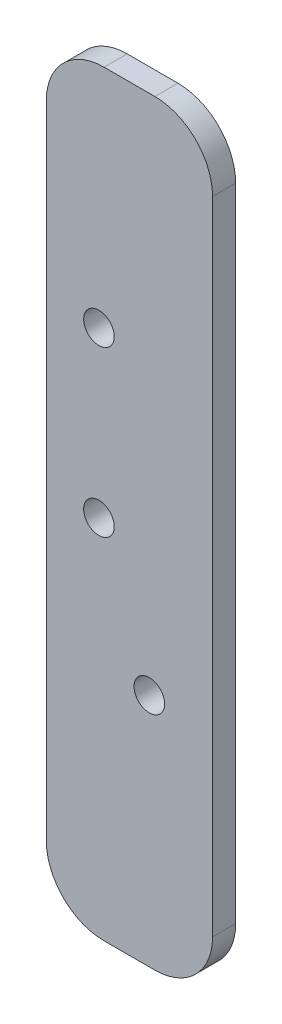
ISO-10303-21;
HEADER;
FILE_DESCRIPTION(('STEP AP214'),'2;1');
FILE_NAME('part.step','',(''),(''),'','','');
FILE_SCHEMA(('AUTOMOTIVE_DESIGN { 1 0 10303 214 1 1 1 1 }'));
ENDSEC;
DATA;
#1=APPLICATION_CONTEXT('core data for automotive mechanical design processes');
#2=APPLICATION_PROTOCOL_DEFINITION('international standard','automotive_design',2000,#1);
#3=PRODUCT_CONTEXT('',#1,'mechanical');
#4=PRODUCT('Part','Part','',(#3));
#5=PRODUCT_RELATED_PRODUCT_CATEGORY('part','',(#4));
#6=PRODUCT_DEFINITION_FORMATION('','',#4);
#7=PRODUCT_DEFINITION_CONTEXT('part definition',#1,'design');
#8=PRODUCT_DEFINITION('design','',#6,#7);
#9=PRODUCT_DEFINITION_SHAPE('','',#8);
#10=(LENGTH_UNIT() NAMED_UNIT(*) SI_UNIT(.MILLI.,.METRE.));
#11=(NAMED_UNIT(*) PLANE_ANGLE_UNIT() SI_UNIT($,.RADIAN.));
#12=(NAMED_UNIT(*) SI_UNIT($,.STERADIAN.) SOLID_ANGLE_UNIT());
#13=UNCERTAINTY_MEASURE_WITH_UNIT(LENGTH_MEASURE(1.E-05),#10,'distance_accuracy_value','');
#14=(GEOMETRIC_REPRESENTATION_CONTEXT(3) GLOBAL_UNCERTAINTY_ASSIGNED_CONTEXT((#13)) GLOBAL_UNIT_ASSIGNED_CONTEXT((#10,
#11,#12)) REPRESENTATION_CONTEXT('',''));
#15=CARTESIAN_POINT('',(0.,0.,0.));
#16=DIRECTION('',(0.,0.,1.));
#17=DIRECTION('',(1.,0.,0.));
#18=AXIS2_PLACEMENT_3D('',#15,#16,#17);
#19=CARTESIAN_POINT('',(-63.2759401965078,-253.855106797616,4.));
#20=DIRECTION('',(1.,0.,0.));
#21=DIRECTION('',(0.,0.,-1.));
#22=AXIS2_PLACEMENT_3D('',#19,#20,#21);
#23=PLANE('',#22);
#24=DIRECTION('',(0.,-1.,0.));
#25=VECTOR('',#24,1.);
#26=CARTESIAN_POINT('',(-63.2759401965078,-253.855106797616,4.));
#27=LINE('',#26,#25);
#28=CARTESIAN_POINT('',(-63.2759401965078,-263.855106797616,4.));
#29=VERTEX_POINT('',#28);
#30=CARTESIAN_POINT('',(-63.2759401965078,-374.933652969776,4.));
#31=VERTEX_POINT('',#30);
#32=EDGE_CURVE('E119',#29,#31,#27,.T.);
#33=ORIENTED_EDGE('',*,*,#32,.F.);
#34=DIRECTION('',(0.,0.,-1.));
#35=VECTOR('',#34,1.);
#36=CARTESIAN_POINT('',(-63.2759401965078,-263.855106797616,4.));
#37=LINE('',#36,#35);
#38=CARTESIAN_POINT('',(-63.2759401965078,-263.855106797616,0.));
#39=VERTEX_POINT('',#38);
#40=EDGE_CURVE('E104',#29,#39,#37,.T.);
#41=ORIENTED_EDGE('',*,*,#40,.T.);
#42=DIRECTION('',(0.,-1.,0.));
#43=VECTOR('',#42,1.);
#44=CARTESIAN_POINT('',(-63.2759401965078,-253.855106797616,0.));
#45=LINE('',#44,#43);
#46=CARTESIAN_POINT('',(-63.2759401965078,-374.933652969776,0.));
#47=VERTEX_POINT('',#46);
#48=EDGE_CURVE('E116',#39,#47,#45,.T.);
#49=ORIENTED_EDGE('',*,*,#48,.T.);
#50=DIRECTION('',(0.,0.,-1.));
#51=VECTOR('',#50,1.);
#52=CARTESIAN_POINT('',(-63.2759401965078,-374.933652969776,4.));
#53=LINE('',#52,#51);
#54=EDGE_CURVE('E121',#47,#31,#53,.F.);
#55=ORIENTED_EDGE('',*,*,#54,.T.);
#56=EDGE_LOOP('',(#33,#41,#49,#55));
#57=FACE_BOUND('',#56,.T.);
#58=ADVANCED_FACE('F33',(#57),#23,.F.);
#59=CARTESIAN_POINT('',(-63.2759401965078,-384.933652969776,4.));
#60=DIRECTION('',(0.,1.,0.));
#61=DIRECTION('',(0.,0.,1.));
#62=AXIS2_PLACEMENT_3D('',#59,#60,#61);
#63=PLANE('',#62);
#64=DIRECTION('',(1.,0.,0.));
#65=VECTOR('',#64,1.);
#66=CARTESIAN_POINT('',(-63.2759401965078,-384.933652969776,4.));
#67=LINE('',#66,#65);
#68=CARTESIAN_POINT('',(-53.2759401965078,-384.933652969776,4.));
#69=VERTEX_POINT('',#68);
#70=CARTESIAN_POINT('',(-44.4730785631655,-384.933652969776,4.));
#71=VERTEX_POINT('',#70);
#72=EDGE_CURVE('E163',#69,#71,#67,.T.);
#73=ORIENTED_EDGE('',*,*,#72,.F.);
#74=DIRECTION('',(0.,0.,-1.));
#75=VECTOR('',#74,1.);
#76=CARTESIAN_POINT('',(-53.2759401965078,-384.933652969776,4.));
#77=LINE('',#76,#75);
#78=CARTESIAN_POINT('',(-53.2759401965078,-384.933652969776,0.));
#79=VERTEX_POINT('',#78);
#80=EDGE_CURVE('E11',#69,#79,#77,.T.);
#81=ORIENTED_EDGE('',*,*,#80,.T.);
#82=DIRECTION('',(1.,0.,0.));
#83=VECTOR('',#82,1.);
#84=CARTESIAN_POINT('',(-63.2759401965078,-384.933652969776,0.));
#85=LINE('',#84,#83);
#86=CARTESIAN_POINT('',(-44.4730785631655,-384.933652969776,0.));
#87=VERTEX_POINT('',#86);
#88=EDGE_CURVE('E126',#79,#87,#85,.T.);
#89=ORIENTED_EDGE('',*,*,#88,.T.);
#90=DIRECTION('',(0.,0.,-1.));
#91=VECTOR('',#90,1.);
#92=CARTESIAN_POINT('',(-44.4730785631655,-384.933652969776,4.));
#93=LINE('',#92,#91);
#94=EDGE_CURVE('E41',#87,#71,#93,.F.);
#95=ORIENTED_EDGE('',*,*,#94,.T.);
#96=EDGE_LOOP('',(#73,#81,#89,#95));
#97=FACE_BOUND('',#96,.T.);
#98=ADVANCED_FACE('F162',(#97),#63,.F.);
#99=CARTESIAN_POINT('',(-34.4730785631655,-253.855106797616,4.));
#100=DIRECTION('',(-1.,0.,0.));
#101=DIRECTION('',(0.,0.,1.));
#102=AXIS2_PLACEMENT_3D('',#99,#100,#101);
#103=PLANE('',#102);
#104=DIRECTION('',(0.,1.,0.));
#105=VECTOR('',#104,1.);
#106=CARTESIAN_POINT('',(-34.4730785631655,-253.855106797616,0.));
#107=LINE('',#106,#105);
#108=CARTESIAN_POINT('',(-34.4730785631655,-374.933652969776,0.));
#109=VERTEX_POINT('',#108);
#110=CARTESIAN_POINT('',(-34.4730785631655,-263.855106797616,0.));
#111=VERTEX_POINT('',#110);
#112=EDGE_CURVE('E130',#109,#111,#107,.T.);
#113=ORIENTED_EDGE('',*,*,#112,.T.);
#114=DIRECTION('',(0.,0.,-1.));
#115=VECTOR('',#114,1.);
#116=CARTESIAN_POINT('',(-34.4730785631655,-263.855106797616,4.));
#117=LINE('',#116,#115);
#118=CARTESIAN_POINT('',(-34.4730785631655,-263.855106797616,4.));
#119=VERTEX_POINT('',#118);
#120=EDGE_CURVE('E48',#111,#119,#117,.F.);
#121=ORIENTED_EDGE('',*,*,#120,.T.);
#122=DIRECTION('',(0.,1.,0.));
#123=VECTOR('',#122,1.);
#124=CARTESIAN_POINT('',(-34.4730785631655,-253.855106797616,4.));
#125=LINE('',#124,#123);
#126=CARTESIAN_POINT('',(-34.4730785631655,-374.933652969776,4.));
#127=VERTEX_POINT('',#126);
#128=EDGE_CURVE('E169',#127,#119,#125,.T.);
#129=ORIENTED_EDGE('',*,*,#128,.F.);
#130=DIRECTION('',(0.,0.,-1.));
#131=VECTOR('',#130,1.);
#132=CARTESIAN_POINT('',(-34.4730785631655,-374.933652969776,4.));
#133=LINE('',#132,#131);
#134=EDGE_CURVE('E156',#127,#109,#133,.T.);
#135=ORIENTED_EDGE('',*,*,#134,.T.);
#136=EDGE_LOOP('',(#113,#121,#129,#135));
#137=FACE_BOUND('',#136,.T.);
#138=ADVANCED_FACE('F173',(#137),#103,.F.);
#139=CARTESIAN_POINT('',(-63.2759401965078,-253.855106797616,4.));
#140=DIRECTION('',(0.,-1.,0.));
#141=DIRECTION('',(0.,0.,-1.));
#142=AXIS2_PLACEMENT_3D('',#139,#140,#141);
#143=PLANE('',#142);
#144=DIRECTION('',(-1.,0.,0.));
#145=VECTOR('',#144,1.);
#146=CARTESIAN_POINT('',(-63.2759401965078,-253.855106797616,0.));
#147=LINE('',#146,#145);
#148=CARTESIAN_POINT('',(-44.4730785631655,-253.855106797616,0.));
#149=VERTEX_POINT('',#148);
#150=CARTESIAN_POINT('',(-53.2759401965078,-253.855106797616,0.));
#151=VERTEX_POINT('',#150);
#152=EDGE_CURVE('E140',#149,#151,#147,.T.);
#153=ORIENTED_EDGE('',*,*,#152,.T.);
#154=DIRECTION('',(0.,0.,-1.));
#155=VECTOR('',#154,1.);
#156=CARTESIAN_POINT('',(-53.2759401965078,-253.855106797616,4.));
#157=LINE('',#156,#155);
#158=CARTESIAN_POINT('',(-53.2759401965078,-253.855106797616,4.));
#159=VERTEX_POINT('',#158);
#160=EDGE_CURVE('E105',#151,#159,#157,.F.);
#161=ORIENTED_EDGE('',*,*,#160,.T.);
#162=DIRECTION('',(-1.,0.,0.));
#163=VECTOR('',#162,1.);
#164=CARTESIAN_POINT('',(-63.2759401965078,-253.855106797616,4.));
#165=LINE('',#164,#163);
#166=CARTESIAN_POINT('',(-44.4730785631655,-253.855106797616,4.));
#167=VERTEX_POINT('',#166);
#168=EDGE_CURVE('E136',#167,#159,#165,.T.);
#169=ORIENTED_EDGE('',*,*,#168,.F.);
#170=DIRECTION('',(0.,0.,-1.));
#171=VECTOR('',#170,1.);
#172=CARTESIAN_POINT('',(-44.4730785631655,-253.855106797616,4.));
#173=LINE('',#172,#171);
#174=EDGE_CURVE('E110',#167,#149,#173,.T.);
#175=ORIENTED_EDGE('',*,*,#174,.T.);
#176=EDGE_LOOP('',(#153,#161,#169,#175));
#177=FACE_BOUND('',#176,.T.);
#178=ADVANCED_FACE('F180',(#177),#143,.F.);
#179=CARTESIAN_POINT('',(0.,0.,4.));
#180=DIRECTION('',(0.,0.,1.));
#181=DIRECTION('',(1.,0.,0.));
#182=AXIS2_PLACEMENT_3D('',#179,#180,#181);
#183=PLANE('',#182);
#184=CARTESIAN_POINT('',(-45.4264270076822,-344.165502046719,4.));
#185=DIRECTION('',(0.,0.,-1.));
#186=DIRECTION('',(-1.,0.,0.));
#187=AXIS2_PLACEMENT_3D('',#184,#185,#186);
#188=CIRCLE('',#187,2.64999999999999);
#189=CARTESIAN_POINT('',(-48.0764270076822,-344.165502046719,4.));
#190=VERTEX_POINT('',#189);
#191=EDGE_CURVE('E191',#190,#190,#188,.T.);
#192=ORIENTED_EDGE('',*,*,#191,.T.);
#193=EDGE_LOOP('',(#192));
#194=FACE_BOUND('',#193,.T.);
#195=CARTESIAN_POINT('',(-54.16270611,-321.91568115646,4.));
#196=DIRECTION('',(0.,0.,1.));
#197=DIRECTION('',(1.,0.,0.));
#198=AXIS2_PLACEMENT_3D('',#195,#196,#197);
#199=CIRCLE('',#198,2.65);
#200=CARTESIAN_POINT('',(-51.51270611,-321.91568115646,4.));
#201=VERTEX_POINT('',#200);
#202=EDGE_CURVE('E188',#201,#201,#199,.T.);
#203=ORIENTED_EDGE('',*,*,#202,.F.);
#204=EDGE_LOOP('',(#203));
#205=FACE_BOUND('',#204,.T.);
#206=CARTESIAN_POINT('',(-54.16270611,-293.415681156461,4.));
#207=DIRECTION('',(0.,0.,1.));
#208=DIRECTION('',(1.,0.,0.));
#209=AXIS2_PLACEMENT_3D('',#206,#207,#208);
#210=CIRCLE('',#209,2.65);
#211=CARTESIAN_POINT('',(-51.51270611,-293.415681156461,4.));
#212=VERTEX_POINT('',#211);
#213=EDGE_CURVE('E133',#212,#212,#210,.T.);
#214=ORIENTED_EDGE('',*,*,#213,.F.);
#215=EDGE_LOOP('',(#214));
#216=FACE_BOUND('',#215,.T.);
#217=ORIENTED_EDGE('',*,*,#168,.T.);
#218=CARTESIAN_POINT('',(-53.2759401965078,-263.855106797616,4.));
#219=DIRECTION('',(0.,0.,1.));
#220=DIRECTION('',(1.,0.,0.));
#221=AXIS2_PLACEMENT_3D('',#218,#219,#220);
#222=CIRCLE('',#221,10.);
#223=EDGE_CURVE('E154',#159,#29,#222,.T.);
#224=ORIENTED_EDGE('',*,*,#223,.T.);
#225=ORIENTED_EDGE('',*,*,#32,.T.);
#226=CARTESIAN_POINT('',(-53.2759401965078,-374.933652969776,4.));
#227=DIRECTION('',(0.,0.,1.));
#228=DIRECTION('',(1.,0.,0.));
#229=AXIS2_PLACEMENT_3D('',#226,#227,#228);
#230=CIRCLE('',#229,10.);
#231=EDGE_CURVE('E150',#31,#69,#230,.T.);
#232=ORIENTED_EDGE('',*,*,#231,.T.);
#233=ORIENTED_EDGE('',*,*,#72,.T.);
#234=CARTESIAN_POINT('',(-44.4730785631655,-374.933652969776,4.));
#235=DIRECTION('',(0.,0.,1.));
#236=DIRECTION('',(1.,0.,0.));
#237=AXIS2_PLACEMENT_3D('',#234,#235,#236);
#238=CIRCLE('',#237,10.);
#239=EDGE_CURVE('E55',#71,#127,#238,.T.);
#240=ORIENTED_EDGE('',*,*,#239,.T.);
#241=ORIENTED_EDGE('',*,*,#128,.T.);
#242=CARTESIAN_POINT('',(-44.4730785631655,-263.855106797616,4.));
#243=DIRECTION('',(0.,0.,1.));
#244=DIRECTION('',(1.,0.,0.));
#245=AXIS2_PLACEMENT_3D('',#242,#243,#244);
#246=CIRCLE('',#245,10.);
#247=EDGE_CURVE('E152',#119,#167,#246,.T.);
#248=ORIENTED_EDGE('',*,*,#247,.T.);
#249=EDGE_LOOP('',(#217,#224,#225,#232,#233,#240,#241,#248));
#250=FACE_BOUND('',#249,.T.);
#251=ADVANCED_FACE('F167',(#194,#205,#216,#250),#183,.T.);
#252=CARTESIAN_POINT('',(0.,0.,0.));
#253=DIRECTION('',(0.,0.,1.));
#254=DIRECTION('',(1.,0.,0.));
#255=AXIS2_PLACEMENT_3D('',#252,#253,#254);
#256=PLANE('',#255);
#257=CARTESIAN_POINT('',(-45.4264270076822,-344.165502046719,0.));
#258=DIRECTION('',(0.,0.,-1.));
#259=DIRECTION('',(-1.,0.,0.));
#260=AXIS2_PLACEMENT_3D('',#257,#258,#259);
#261=CIRCLE('',#260,2.64999999999999);
#262=CARTESIAN_POINT('',(-48.0764270076822,-344.165502046719,0.));
#263=VERTEX_POINT('',#262);
#264=EDGE_CURVE('E194',#263,#263,#261,.T.);
#265=ORIENTED_EDGE('',*,*,#264,.F.);
#266=EDGE_LOOP('',(#265));
#267=FACE_BOUND('',#266,.T.);
#268=CARTESIAN_POINT('',(-54.16270611,-321.91568115646,0.));
#269=DIRECTION('',(0.,0.,1.));
#270=DIRECTION('',(1.,0.,0.));
#271=AXIS2_PLACEMENT_3D('',#268,#269,#270);
#272=CIRCLE('',#271,2.65);
#273=CARTESIAN_POINT('',(-51.51270611,-321.91568115646,0.));
#274=VERTEX_POINT('',#273);
#275=EDGE_CURVE('E185',#274,#274,#272,.T.);
#276=ORIENTED_EDGE('',*,*,#275,.T.);
#277=EDGE_LOOP('',(#276));
#278=FACE_BOUND('',#277,.T.);
#279=CARTESIAN_POINT('',(-54.16270611,-293.415681156461,0.));
#280=DIRECTION('',(0.,0.,1.));
#281=DIRECTION('',(1.,0.,0.));
#282=AXIS2_PLACEMENT_3D('',#279,#280,#281);
#283=CIRCLE('',#282,2.65);
#284=CARTESIAN_POINT('',(-51.51270611,-293.415681156461,0.));
#285=VERTEX_POINT('',#284);
#286=EDGE_CURVE('E127',#285,#285,#283,.T.);
#287=ORIENTED_EDGE('',*,*,#286,.T.);
#288=EDGE_LOOP('',(#287));
#289=FACE_BOUND('',#288,.T.);
#290=ORIENTED_EDGE('',*,*,#48,.F.);
#291=CARTESIAN_POINT('',(-53.2759401965078,-263.855106797616,0.));
#292=DIRECTION('',(0.,0.,1.));
#293=DIRECTION('',(1.,0.,0.));
#294=AXIS2_PLACEMENT_3D('',#291,#292,#293);
#295=CIRCLE('',#294,10.);
#296=EDGE_CURVE('E100',#39,#151,#295,.F.);
#297=ORIENTED_EDGE('',*,*,#296,.T.);
#298=ORIENTED_EDGE('',*,*,#152,.F.);
#299=CARTESIAN_POINT('',(-44.4730785631655,-263.855106797616,0.));
#300=DIRECTION('',(0.,0.,1.));
#301=DIRECTION('',(1.,0.,0.));
#302=AXIS2_PLACEMENT_3D('',#299,#300,#301);
#303=CIRCLE('',#302,10.);
#304=EDGE_CURVE('E111',#149,#111,#303,.F.);
#305=ORIENTED_EDGE('',*,*,#304,.T.);
#306=ORIENTED_EDGE('',*,*,#112,.F.);
#307=CARTESIAN_POINT('',(-44.4730785631655,-374.933652969776,0.));
#308=DIRECTION('',(0.,0.,1.));
#309=DIRECTION('',(1.,0.,0.));
#310=AXIS2_PLACEMENT_3D('',#307,#308,#309);
#311=CIRCLE('',#310,10.);
#312=EDGE_CURVE('E120',#109,#87,#311,.F.);
#313=ORIENTED_EDGE('',*,*,#312,.T.);
#314=ORIENTED_EDGE('',*,*,#88,.F.);
#315=CARTESIAN_POINT('',(-53.2759401965078,-374.933652969776,0.));
#316=DIRECTION('',(0.,0.,1.));
#317=DIRECTION('',(1.,0.,0.));
#318=AXIS2_PLACEMENT_3D('',#315,#316,#317);
#319=CIRCLE('',#318,10.);
#320=EDGE_CURVE('E125',#79,#47,#319,.F.);
#321=ORIENTED_EDGE('',*,*,#320,.T.);
#322=EDGE_LOOP('',(#290,#297,#298,#305,#306,#313,#314,#321));
#323=FACE_BOUND('',#322,.T.);
#324=ADVANCED_FACE('F123',(#267,#278,#289,#323),#256,.F.);
#325=CARTESIAN_POINT('',(-54.16270611,-293.415681156461,4.));
#326=DIRECTION('',(0.,0.,1.));
#327=DIRECTION('',(1.,0.,0.));
#328=AXIS2_PLACEMENT_3D('',#325,#326,#327);
#329=CYLINDRICAL_SURFACE('',#328,2.65);
#330=ORIENTED_EDGE('',*,*,#286,.F.);
#331=EDGE_LOOP('',(#330));
#332=FACE_BOUND('',#331,.T.);
#333=ORIENTED_EDGE('',*,*,#213,.T.);
#334=EDGE_LOOP('',(#333));
#335=FACE_BOUND('',#334,.T.);
#336=ADVANCED_FACE('F202',(#332,#335),#329,.F.);
#337=CARTESIAN_POINT('',(-54.16270611,-321.91568115646,4.));
#338=DIRECTION('',(0.,0.,1.));
#339=DIRECTION('',(1.,0.,0.));
#340=AXIS2_PLACEMENT_3D('',#337,#338,#339);
#341=CYLINDRICAL_SURFACE('',#340,2.65);
#342=ORIENTED_EDGE('',*,*,#275,.F.);
#343=EDGE_LOOP('',(#342));
#344=FACE_BOUND('',#343,.T.);
#345=ORIENTED_EDGE('',*,*,#202,.T.);
#346=EDGE_LOOP('',(#345));
#347=FACE_BOUND('',#346,.T.);
#348=ADVANCED_FACE('F210',(#344,#347),#341,.F.);
#349=CARTESIAN_POINT('',(-53.2759401965078,-263.855106797616,4.));
#350=DIRECTION('',(0.,0.,-1.));
#351=DIRECTION('',(-1.,0.,0.));
#352=AXIS2_PLACEMENT_3D('',#349,#350,#351);
#353=CYLINDRICAL_SURFACE('',#352,10.);
#354=ORIENTED_EDGE('',*,*,#223,.F.);
#355=ORIENTED_EDGE('',*,*,#160,.F.);
#356=ORIENTED_EDGE('',*,*,#296,.F.);
#357=ORIENTED_EDGE('',*,*,#40,.F.);
#358=EDGE_LOOP('',(#354,#355,#356,#357));
#359=FACE_BOUND('',#358,.T.);
#360=ADVANCED_FACE('F103',(#359),#353,.T.);
#361=CARTESIAN_POINT('',(-44.4730785631655,-263.855106797616,4.));
#362=DIRECTION('',(0.,0.,-1.));
#363=DIRECTION('',(-1.,0.,0.));
#364=AXIS2_PLACEMENT_3D('',#361,#362,#363);
#365=CYLINDRICAL_SURFACE('',#364,10.);
#366=ORIENTED_EDGE('',*,*,#247,.F.);
#367=ORIENTED_EDGE('',*,*,#120,.F.);
#368=ORIENTED_EDGE('',*,*,#304,.F.);
#369=ORIENTED_EDGE('',*,*,#174,.F.);
#370=EDGE_LOOP('',(#366,#367,#368,#369));
#371=FACE_BOUND('',#370,.T.);
#372=ADVANCED_FACE('F177',(#371),#365,.T.);
#373=CARTESIAN_POINT('',(-53.2759401965078,-374.933652969776,4.));
#374=DIRECTION('',(0.,0.,-1.));
#375=DIRECTION('',(-1.,0.,0.));
#376=AXIS2_PLACEMENT_3D('',#373,#374,#375);
#377=CYLINDRICAL_SURFACE('',#376,10.);
#378=ORIENTED_EDGE('',*,*,#231,.F.);
#379=ORIENTED_EDGE('',*,*,#54,.F.);
#380=ORIENTED_EDGE('',*,*,#320,.F.);
#381=ORIENTED_EDGE('',*,*,#80,.F.);
#382=EDGE_LOOP('',(#378,#379,#380,#381));
#383=FACE_BOUND('',#382,.T.);
#384=ADVANCED_FACE('F233',(#383),#377,.T.);
#385=CARTESIAN_POINT('',(-44.4730785631655,-374.933652969776,4.));
#386=DIRECTION('',(0.,0.,-1.));
#387=DIRECTION('',(-1.,0.,0.));
#388=AXIS2_PLACEMENT_3D('',#385,#386,#387);
#389=CYLINDRICAL_SURFACE('',#388,10.);
#390=ORIENTED_EDGE('',*,*,#239,.F.);
#391=ORIENTED_EDGE('',*,*,#94,.F.);
#392=ORIENTED_EDGE('',*,*,#312,.F.);
#393=ORIENTED_EDGE('',*,*,#134,.F.);
#394=EDGE_LOOP('',(#390,#391,#392,#393));
#395=FACE_BOUND('',#394,.T.);
#396=ADVANCED_FACE('F35',(#395),#389,.T.);
#397=CARTESIAN_POINT('',(-45.4264270076822,-344.165502046719,0.));
#398=DIRECTION('',(0.,0.,-1.));
#399=DIRECTION('',(-1.,0.,0.));
#400=AXIS2_PLACEMENT_3D('',#397,#398,#399);
#401=CYLINDRICAL_SURFACE('',#400,2.64999999999999);
#402=ORIENTED_EDGE('',*,*,#191,.F.);
#403=EDGE_LOOP('',(#402));
#404=FACE_BOUND('',#403,.T.);
#405=ORIENTED_EDGE('',*,*,#264,.T.);
#406=EDGE_LOOP('',(#405));
#407=FACE_BOUND('',#406,.T.);
#408=ADVANCED_FACE('F198',(#404,#407),#401,.F.);
#409=CLOSED_SHELL('',(#58,#98,#138,#178,#251,#324,#336,#348,#360,#372,#384,#396,#408));
#410=MANIFOLD_SOLID_BREP('B2',#409);
#411=ADVANCED_BREP_SHAPE_REPRESENTATION('',(#18,#410),#14);
#412=SHAPE_DEFINITION_REPRESENTATION(#9,#411);
ENDSEC;
END-ISO-10303-21;
